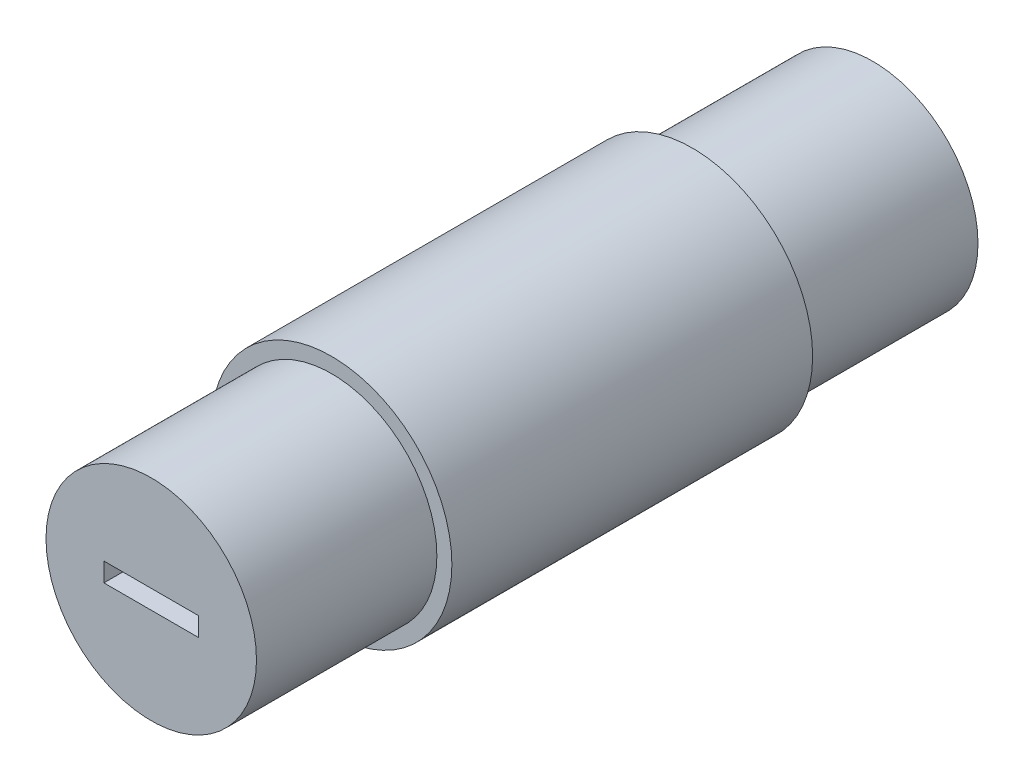
ISO-10303-21;
HEADER;
FILE_DESCRIPTION(('STEP AP214'),'2;1');
FILE_NAME('part.step','',(''),(''),'','','');
FILE_SCHEMA(('AUTOMOTIVE_DESIGN { 1 0 10303 214 1 1 1 1 }'));
ENDSEC;
DATA;
#1=APPLICATION_CONTEXT('core data for automotive mechanical design processes');
#2=APPLICATION_PROTOCOL_DEFINITION('international standard','automotive_design',2000,#1);
#3=PRODUCT_CONTEXT('',#1,'mechanical');
#4=PRODUCT('Part','Part','',(#3));
#5=PRODUCT_RELATED_PRODUCT_CATEGORY('part','',(#4));
#6=PRODUCT_DEFINITION_FORMATION('','',#4);
#7=PRODUCT_DEFINITION_CONTEXT('part definition',#1,'design');
#8=PRODUCT_DEFINITION('design','',#6,#7);
#9=PRODUCT_DEFINITION_SHAPE('','',#8);
#10=(LENGTH_UNIT() NAMED_UNIT(*) SI_UNIT(.MILLI.,.METRE.));
#11=(NAMED_UNIT(*) PLANE_ANGLE_UNIT() SI_UNIT($,.RADIAN.));
#12=(NAMED_UNIT(*) SI_UNIT($,.STERADIAN.) SOLID_ANGLE_UNIT());
#13=UNCERTAINTY_MEASURE_WITH_UNIT(LENGTH_MEASURE(1.E-05),#10,'distance_accuracy_value','');
#14=(GEOMETRIC_REPRESENTATION_CONTEXT(3) GLOBAL_UNCERTAINTY_ASSIGNED_CONTEXT((#13)) GLOBAL_UNIT_ASSIGNED_CONTEXT((#10,
#11,#12)) REPRESENTATION_CONTEXT('',''));
#15=CARTESIAN_POINT('',(0.,0.,0.));
#16=DIRECTION('',(0.,0.,1.));
#17=DIRECTION('',(1.,0.,0.));
#18=AXIS2_PLACEMENT_3D('',#15,#16,#17);
#19=CARTESIAN_POINT('',(0.,0.,-38.1));
#20=DIRECTION('',(0.,0.,1.));
#21=DIRECTION('',(1.,0.,0.));
#22=AXIS2_PLACEMENT_3D('',#19,#20,#21);
#23=PLANE('',#22);
#24=CARTESIAN_POINT('',(0.,0.,-38.1));
#25=DIRECTION('',(0.,0.,1.));
#26=DIRECTION('',(1.,0.,0.));
#27=AXIS2_PLACEMENT_3D('',#24,#25,#26);
#28=CIRCLE('',#27,11.115);
#29=CARTESIAN_POINT('',(11.1149999999999,0.,-38.1));
#30=VERTEX_POINT('',#29);
#31=EDGE_CURVE('E719',#30,#30,#28,.T.);
#32=ORIENTED_EDGE('',*,*,#31,.F.);
#33=EDGE_LOOP('',(#32));
#34=FACE_BOUND('',#33,.T.);
#35=DIRECTION('',(0.,-1.,0.));
#36=VECTOR('',#35,1.);
#37=CARTESIAN_POINT('',(-5.00000000000009,1.,-38.1));
#38=LINE('',#37,#36);
#39=CARTESIAN_POINT('',(-5.00000000000009,1.,-38.1));
#40=VERTEX_POINT('',#39);
#41=CARTESIAN_POINT('',(-5.00000000000009,-1.,-38.1));
#42=VERTEX_POINT('',#41);
#43=EDGE_CURVE('E606',#40,#42,#38,.T.);
#44=ORIENTED_EDGE('',*,*,#43,.T.);
#45=DIRECTION('',(1.,0.,0.));
#46=VECTOR('',#45,1.);
#47=CARTESIAN_POINT('',(-5.00000000000009,-1.,-38.1));
#48=LINE('',#47,#46);
#49=CARTESIAN_POINT('',(4.99999999999993,-1.,-38.1));
#50=VERTEX_POINT('',#49);
#51=EDGE_CURVE('E677',#42,#50,#48,.T.);
#52=ORIENTED_EDGE('',*,*,#51,.T.);
#53=DIRECTION('',(0.,1.,0.));
#54=VECTOR('',#53,1.);
#55=CARTESIAN_POINT('',(4.99999999999993,1.,-38.1));
#56=LINE('',#55,#54);
#57=CARTESIAN_POINT('',(4.99999999999993,1.,-38.1));
#58=VERTEX_POINT('',#57);
#59=EDGE_CURVE('E663',#50,#58,#56,.T.);
#60=ORIENTED_EDGE('',*,*,#59,.T.);
#61=DIRECTION('',(-1.,0.,0.));
#62=VECTOR('',#61,1.);
#63=CARTESIAN_POINT('',(-5.00000000000009,1.,-38.1));
#64=LINE('',#63,#62);
#65=EDGE_CURVE('E673',#58,#40,#64,.T.);
#66=ORIENTED_EDGE('',*,*,#65,.T.);
#67=EDGE_LOOP('',(#44,#52,#60,#66));
#68=FACE_BOUND('',#67,.T.);
#69=ADVANCED_FACE('F591',(#34,#68),#23,.F.);
#70=CARTESIAN_POINT('',(0.,0.,38.1));
#71=DIRECTION('',(0.,0.,-1.));
#72=DIRECTION('',(-1.,0.,0.));
#73=AXIS2_PLACEMENT_3D('',#70,#71,#72);
#74=CYLINDRICAL_SURFACE('',#73,12.7);
#75=CARTESIAN_POINT('',(0.,0.,19.05));
#76=DIRECTION('',(0.,0.,1.));
#77=DIRECTION('',(1.,0.,0.));
#78=AXIS2_PLACEMENT_3D('',#75,#76,#77);
#79=CIRCLE('',#78,12.7);
#80=CARTESIAN_POINT('',(12.7,0.,19.05));
#81=VERTEX_POINT('',#80);
#82=EDGE_CURVE('E12',#81,#81,#79,.T.);
#83=ORIENTED_EDGE('',*,*,#82,.F.);
#84=EDGE_LOOP('',(#83));
#85=FACE_BOUND('',#84,.T.);
#86=CARTESIAN_POINT('',(0.,0.,-19.05));
#87=DIRECTION('',(0.,0.,1.));
#88=DIRECTION('',(1.,0.,0.));
#89=AXIS2_PLACEMENT_3D('',#86,#87,#88);
#90=CIRCLE('',#89,12.7);
#91=CARTESIAN_POINT('',(12.7,0.,-19.05));
#92=VERTEX_POINT('',#91);
#93=EDGE_CURVE('E730',#92,#92,#90,.T.);
#94=ORIENTED_EDGE('',*,*,#93,.T.);
#95=EDGE_LOOP('',(#94));
#96=FACE_BOUND('',#95,.T.);
#97=ADVANCED_FACE('F593',(#85,#96),#74,.T.);
#98=CARTESIAN_POINT('',(0.,0.,19.05));
#99=DIRECTION('',(0.,0.,1.));
#100=DIRECTION('',(1.,0.,0.));
#101=AXIS2_PLACEMENT_3D('',#98,#99,#100);
#102=PLANE('',#101);
#103=CARTESIAN_POINT('',(0.,0.,19.05));
#104=DIRECTION('',(0.,0.,1.));
#105=DIRECTION('',(1.,0.,0.));
#106=AXIS2_PLACEMENT_3D('',#103,#104,#105);
#107=CIRCLE('',#106,11.115);
#108=CARTESIAN_POINT('',(11.115,0.,19.05));
#109=VERTEX_POINT('',#108);
#110=EDGE_CURVE('E599',#109,#109,#107,.T.);
#111=ORIENTED_EDGE('',*,*,#110,.F.);
#112=EDGE_LOOP('',(#111));
#113=FACE_BOUND('',#112,.T.);
#114=ORIENTED_EDGE('',*,*,#82,.T.);
#115=EDGE_LOOP('',(#114));
#116=FACE_BOUND('',#115,.T.);
#117=ADVANCED_FACE('F741',(#113,#116),#102,.T.);
#118=CARTESIAN_POINT('',(0.,0.,19.05));
#119=DIRECTION('',(0.,0.,1.));
#120=DIRECTION('',(1.,0.,0.));
#121=AXIS2_PLACEMENT_3D('',#118,#119,#120);
#122=CYLINDRICAL_SURFACE('',#121,11.115);
#123=ORIENTED_EDGE('',*,*,#110,.T.);
#124=EDGE_LOOP('',(#123));
#125=FACE_BOUND('',#124,.T.);
#126=CARTESIAN_POINT('',(0.,0.,38.1));
#127=DIRECTION('',(0.,0.,1.));
#128=DIRECTION('',(1.,0.,0.));
#129=AXIS2_PLACEMENT_3D('',#126,#127,#128);
#130=CIRCLE('',#129,11.115);
#131=CARTESIAN_POINT('',(11.1150000000001,0.,38.1));
#132=VERTEX_POINT('',#131);
#133=EDGE_CURVE('E733',#132,#132,#130,.T.);
#134=ORIENTED_EDGE('',*,*,#133,.F.);
#135=EDGE_LOOP('',(#134));
#136=FACE_BOUND('',#135,.T.);
#137=ADVANCED_FACE('F738',(#125,#136),#122,.T.);
#138=CARTESIAN_POINT('',(0.,0.,38.1));
#139=DIRECTION('',(0.,0.,1.));
#140=DIRECTION('',(1.,0.,0.));
#141=AXIS2_PLACEMENT_3D('',#138,#139,#140);
#142=PLANE('',#141);
#143=DIRECTION('',(0.,-1.,0.));
#144=VECTOR('',#143,1.);
#145=CARTESIAN_POINT('',(-4.99999999999993,1.,38.1));
#146=LINE('',#145,#144);
#147=CARTESIAN_POINT('',(-4.99999999999993,1.,38.1));
#148=VERTEX_POINT('',#147);
#149=CARTESIAN_POINT('',(-4.99999999999993,-1.,38.1));
#150=VERTEX_POINT('',#149);
#151=EDGE_CURVE('E614',#148,#150,#146,.T.);
#152=ORIENTED_EDGE('',*,*,#151,.F.);
#153=DIRECTION('',(-1.,0.,0.));
#154=VECTOR('',#153,1.);
#155=CARTESIAN_POINT('',(-4.99999999999993,1.,38.1));
#156=LINE('',#155,#154);
#157=CARTESIAN_POINT('',(5.00000000000009,1.,38.1));
#158=VERTEX_POINT('',#157);
#159=EDGE_CURVE('E701',#158,#148,#156,.T.);
#160=ORIENTED_EDGE('',*,*,#159,.F.);
#161=DIRECTION('',(0.,1.,0.));
#162=VECTOR('',#161,1.);
#163=CARTESIAN_POINT('',(5.00000000000009,1.,38.1));
#164=LINE('',#163,#162);
#165=CARTESIAN_POINT('',(5.00000000000009,-1.,38.1));
#166=VERTEX_POINT('',#165);
#167=EDGE_CURVE('E698',#166,#158,#164,.T.);
#168=ORIENTED_EDGE('',*,*,#167,.F.);
#169=DIRECTION('',(1.,0.,0.));
#170=VECTOR('',#169,1.);
#171=CARTESIAN_POINT('',(-4.99999999999993,-1.,38.1));
#172=LINE('',#171,#170);
#173=EDGE_CURVE('E695',#150,#166,#172,.T.);
#174=ORIENTED_EDGE('',*,*,#173,.F.);
#175=EDGE_LOOP('',(#152,#160,#168,#174));
#176=FACE_BOUND('',#175,.T.);
#177=ORIENTED_EDGE('',*,*,#133,.T.);
#178=EDGE_LOOP('',(#177));
#179=FACE_BOUND('',#178,.T.);
#180=ADVANCED_FACE('F755',(#176,#179),#142,.T.);
#181=CARTESIAN_POINT('',(0.,0.,-19.05));
#182=DIRECTION('',(0.,0.,-1.));
#183=DIRECTION('',(1.,0.,0.));
#184=AXIS2_PLACEMENT_3D('',#181,#182,#183);
#185=PLANE('',#184);
#186=ORIENTED_EDGE('',*,*,#93,.F.);
#187=EDGE_LOOP('',(#186));
#188=FACE_BOUND('',#187,.T.);
#189=CARTESIAN_POINT('',(0.,0.,-19.05));
#190=DIRECTION('',(0.,0.,1.));
#191=DIRECTION('',(1.,0.,0.));
#192=AXIS2_PLACEMENT_3D('',#189,#190,#191);
#193=CIRCLE('',#192,11.115);
#194=CARTESIAN_POINT('',(11.115,0.,-19.05));
#195=VERTEX_POINT('',#194);
#196=EDGE_CURVE('E727',#195,#195,#193,.T.);
#197=ORIENTED_EDGE('',*,*,#196,.T.);
#198=EDGE_LOOP('',(#197));
#199=FACE_BOUND('',#198,.T.);
#200=ADVANCED_FACE('F751',(#188,#199),#185,.T.);
#201=CARTESIAN_POINT('',(0.,0.,-19.05));
#202=DIRECTION('',(0.,0.,-1.));
#203=DIRECTION('',(-1.,0.,0.));
#204=AXIS2_PLACEMENT_3D('',#201,#202,#203);
#205=CYLINDRICAL_SURFACE('',#204,11.115);
#206=ORIENTED_EDGE('',*,*,#196,.F.);
#207=EDGE_LOOP('',(#206));
#208=FACE_BOUND('',#207,.T.);
#209=ORIENTED_EDGE('',*,*,#31,.T.);
#210=EDGE_LOOP('',(#209));
#211=FACE_BOUND('',#210,.T.);
#212=ADVANCED_FACE('F754',(#208,#211),#205,.T.);
#213=CARTESIAN_POINT('',(-4.99999999999995,1.,32.1));
#214=DIRECTION('',(-1.,0.,0.));
#215=DIRECTION('',(0.,0.,1.));
#216=AXIS2_PLACEMENT_3D('',#213,#214,#215);
#217=PLANE('',#216);
#218=ORIENTED_EDGE('',*,*,#151,.T.);
#219=DIRECTION('',(0.,0.,1.));
#220=VECTOR('',#219,1.);
#221=CARTESIAN_POINT('',(-4.99999999999995,-1.,32.1));
#222=LINE('',#221,#220);
#223=CARTESIAN_POINT('',(-4.99999999999995,-1.,32.1));
#224=VERTEX_POINT('',#223);
#225=EDGE_CURVE('E716',#224,#150,#222,.T.);
#226=ORIENTED_EDGE('',*,*,#225,.F.);
#227=DIRECTION('',(0.,-1.,0.));
#228=VECTOR('',#227,1.);
#229=CARTESIAN_POINT('',(-4.99999999999995,1.,32.1));
#230=LINE('',#229,#228);
#231=CARTESIAN_POINT('',(-4.99999999999995,1.,32.1));
#232=VERTEX_POINT('',#231);
#233=EDGE_CURVE('E704',#232,#224,#230,.T.);
#234=ORIENTED_EDGE('',*,*,#233,.F.);
#235=DIRECTION('',(0.,0.,1.));
#236=VECTOR('',#235,1.);
#237=CARTESIAN_POINT('',(-4.99999999999995,1.,32.1));
#238=LINE('',#237,#236);
#239=EDGE_CURVE('E717',#232,#148,#238,.T.);
#240=ORIENTED_EDGE('',*,*,#239,.T.);
#241=EDGE_LOOP('',(#218,#226,#234,#240));
#242=FACE_BOUND('',#241,.T.);
#243=ADVANCED_FACE('F761',(#242),#217,.F.);
#244=CARTESIAN_POINT('',(-4.99999999999995,1.,32.1));
#245=DIRECTION('',(0.,1.,0.));
#246=DIRECTION('',(-1.,0.,0.));
#247=AXIS2_PLACEMENT_3D('',#244,#245,#246);
#248=PLANE('',#247);
#249=ORIENTED_EDGE('',*,*,#159,.T.);
#250=ORIENTED_EDGE('',*,*,#239,.F.);
#251=DIRECTION('',(-1.,0.,0.));
#252=VECTOR('',#251,1.);
#253=CARTESIAN_POINT('',(-4.99999999999995,1.,32.1));
#254=LINE('',#253,#252);
#255=CARTESIAN_POINT('',(5.00000000000007,1.,32.1));
#256=VERTEX_POINT('',#255);
#257=EDGE_CURVE('E713',#256,#232,#254,.T.);
#258=ORIENTED_EDGE('',*,*,#257,.F.);
#259=DIRECTION('',(0.,0.,1.));
#260=VECTOR('',#259,1.);
#261=CARTESIAN_POINT('',(5.00000000000007,1.,32.1));
#262=LINE('',#261,#260);
#263=EDGE_CURVE('E720',#256,#158,#262,.T.);
#264=ORIENTED_EDGE('',*,*,#263,.T.);
#265=EDGE_LOOP('',(#249,#250,#258,#264));
#266=FACE_BOUND('',#265,.T.);
#267=ADVANCED_FACE('F789',(#266),#248,.F.);
#268=CARTESIAN_POINT('',(5.00000000000007,1.,32.1));
#269=DIRECTION('',(1.,0.,0.));
#270=DIRECTION('',(0.,0.,-1.));
#271=AXIS2_PLACEMENT_3D('',#268,#269,#270);
#272=PLANE('',#271);
#273=ORIENTED_EDGE('',*,*,#167,.T.);
#274=ORIENTED_EDGE('',*,*,#263,.F.);
#275=DIRECTION('',(0.,1.,0.));
#276=VECTOR('',#275,1.);
#277=CARTESIAN_POINT('',(5.00000000000007,1.,32.1));
#278=LINE('',#277,#276);
#279=CARTESIAN_POINT('',(5.00000000000007,-1.,32.1));
#280=VERTEX_POINT('',#279);
#281=EDGE_CURVE('E710',#280,#256,#278,.T.);
#282=ORIENTED_EDGE('',*,*,#281,.F.);
#283=DIRECTION('',(0.,0.,1.));
#284=VECTOR('',#283,1.);
#285=CARTESIAN_POINT('',(5.00000000000007,-1.,32.1));
#286=LINE('',#285,#284);
#287=EDGE_CURVE('E722',#280,#166,#286,.T.);
#288=ORIENTED_EDGE('',*,*,#287,.T.);
#289=EDGE_LOOP('',(#273,#274,#282,#288));
#290=FACE_BOUND('',#289,.T.);
#291=ADVANCED_FACE('F791',(#290),#272,.F.);
#292=CARTESIAN_POINT('',(-4.99999999999995,-1.,32.1));
#293=DIRECTION('',(0.,-1.,0.));
#294=DIRECTION('',(1.,0.,0.));
#295=AXIS2_PLACEMENT_3D('',#292,#293,#294);
#296=PLANE('',#295);
#297=ORIENTED_EDGE('',*,*,#173,.T.);
#298=ORIENTED_EDGE('',*,*,#287,.F.);
#299=DIRECTION('',(1.,0.,0.));
#300=VECTOR('',#299,1.);
#301=CARTESIAN_POINT('',(-4.99999999999995,-1.,32.1));
#302=LINE('',#301,#300);
#303=EDGE_CURVE('E707',#224,#280,#302,.T.);
#304=ORIENTED_EDGE('',*,*,#303,.F.);
#305=ORIENTED_EDGE('',*,*,#225,.T.);
#306=EDGE_LOOP('',(#297,#298,#304,#305));
#307=FACE_BOUND('',#306,.T.);
#308=ADVANCED_FACE('F781',(#307),#296,.F.);
#309=CARTESIAN_POINT('',(-4.99999999999995,-1.,32.1));
#310=DIRECTION('',(0.,0.,1.));
#311=DIRECTION('',(1.,0.,0.));
#312=AXIS2_PLACEMENT_3D('',#309,#310,#311);
#313=PLANE('',#312);
#314=ORIENTED_EDGE('',*,*,#233,.T.);
#315=ORIENTED_EDGE('',*,*,#303,.T.);
#316=ORIENTED_EDGE('',*,*,#281,.T.);
#317=ORIENTED_EDGE('',*,*,#257,.T.);
#318=EDGE_LOOP('',(#314,#315,#316,#317));
#319=FACE_BOUND('',#318,.T.);
#320=ADVANCED_FACE('F787',(#319),#313,.T.);
#321=CARTESIAN_POINT('',(-5.00000000000007,1.,-32.1));
#322=DIRECTION('',(1.,0.,0.));
#323=DIRECTION('',(0.,0.,-1.));
#324=AXIS2_PLACEMENT_3D('',#321,#322,#323);
#325=PLANE('',#324);
#326=ORIENTED_EDGE('',*,*,#43,.F.);
#327=DIRECTION('',(0.,0.,-1.));
#328=VECTOR('',#327,1.);
#329=CARTESIAN_POINT('',(-5.00000000000007,1.,-32.1));
#330=LINE('',#329,#328);
#331=CARTESIAN_POINT('',(-5.00000000000007,1.,-32.1));
#332=VERTEX_POINT('',#331);
#333=EDGE_CURVE('E670',#332,#40,#330,.T.);
#334=ORIENTED_EDGE('',*,*,#333,.F.);
#335=DIRECTION('',(0.,-1.,0.));
#336=VECTOR('',#335,1.);
#337=CARTESIAN_POINT('',(-5.00000000000007,1.,-32.1));
#338=LINE('',#337,#336);
#339=CARTESIAN_POINT('',(-5.00000000000007,-1.,-32.1));
#340=VERTEX_POINT('',#339);
#341=EDGE_CURVE('E679',#332,#340,#338,.T.);
#342=ORIENTED_EDGE('',*,*,#341,.T.);
#343=DIRECTION('',(0.,0.,-1.));
#344=VECTOR('',#343,1.);
#345=CARTESIAN_POINT('',(-5.00000000000007,-1.,-32.1));
#346=LINE('',#345,#344);
#347=EDGE_CURVE('E690',#340,#42,#346,.T.);
#348=ORIENTED_EDGE('',*,*,#347,.T.);
#349=EDGE_LOOP('',(#326,#334,#342,#348));
#350=FACE_BOUND('',#349,.T.);
#351=ADVANCED_FACE('F823',(#350),#325,.T.);
#352=CARTESIAN_POINT('',(-5.00000000000007,-1.,-32.1));
#353=DIRECTION('',(0.,1.,0.));
#354=DIRECTION('',(-1.,0.,0.));
#355=AXIS2_PLACEMENT_3D('',#352,#353,#354);
#356=PLANE('',#355);
#357=ORIENTED_EDGE('',*,*,#51,.F.);
#358=ORIENTED_EDGE('',*,*,#347,.F.);
#359=DIRECTION('',(1.,0.,0.));
#360=VECTOR('',#359,1.);
#361=CARTESIAN_POINT('',(-5.00000000000007,-1.,-32.1));
#362=LINE('',#361,#360);
#363=CARTESIAN_POINT('',(4.99999999999995,-1.,-32.1));
#364=VERTEX_POINT('',#363);
#365=EDGE_CURVE('E688',#340,#364,#362,.T.);
#366=ORIENTED_EDGE('',*,*,#365,.T.);
#367=DIRECTION('',(0.,0.,-1.));
#368=VECTOR('',#367,1.);
#369=CARTESIAN_POINT('',(4.99999999999995,-1.,-32.1));
#370=LINE('',#369,#368);
#371=EDGE_CURVE('E669',#364,#50,#370,.T.);
#372=ORIENTED_EDGE('',*,*,#371,.T.);
#373=EDGE_LOOP('',(#357,#358,#366,#372));
#374=FACE_BOUND('',#373,.T.);
#375=ADVANCED_FACE('F832',(#374),#356,.T.);
#376=CARTESIAN_POINT('',(4.99999999999995,1.,-32.1));
#377=DIRECTION('',(-1.,0.,0.));
#378=DIRECTION('',(0.,0.,1.));
#379=AXIS2_PLACEMENT_3D('',#376,#377,#378);
#380=PLANE('',#379);
#381=ORIENTED_EDGE('',*,*,#59,.F.);
#382=ORIENTED_EDGE('',*,*,#371,.F.);
#383=DIRECTION('',(0.,1.,0.));
#384=VECTOR('',#383,1.);
#385=CARTESIAN_POINT('',(4.99999999999995,1.,-32.1));
#386=LINE('',#385,#384);
#387=CARTESIAN_POINT('',(4.99999999999995,1.,-32.1));
#388=VERTEX_POINT('',#387);
#389=EDGE_CURVE('E666',#364,#388,#386,.T.);
#390=ORIENTED_EDGE('',*,*,#389,.T.);
#391=DIRECTION('',(0.,0.,-1.));
#392=VECTOR('',#391,1.);
#393=CARTESIAN_POINT('',(4.99999999999995,1.,-32.1));
#394=LINE('',#393,#392);
#395=EDGE_CURVE('E658',#388,#58,#394,.T.);
#396=ORIENTED_EDGE('',*,*,#395,.T.);
#397=EDGE_LOOP('',(#381,#382,#390,#396));
#398=FACE_BOUND('',#397,.T.);
#399=ADVANCED_FACE('F660',(#398),#380,.T.);
#400=CARTESIAN_POINT('',(-5.00000000000007,1.,-32.1));
#401=DIRECTION('',(0.,-1.,0.));
#402=DIRECTION('',(1.,0.,0.));
#403=AXIS2_PLACEMENT_3D('',#400,#401,#402);
#404=PLANE('',#403);
#405=ORIENTED_EDGE('',*,*,#65,.F.);
#406=ORIENTED_EDGE('',*,*,#395,.F.);
#407=DIRECTION('',(-1.,0.,0.));
#408=VECTOR('',#407,1.);
#409=CARTESIAN_POINT('',(-5.00000000000007,1.,-32.1));
#410=LINE('',#409,#408);
#411=EDGE_CURVE('E685',#388,#332,#410,.T.);
#412=ORIENTED_EDGE('',*,*,#411,.T.);
#413=ORIENTED_EDGE('',*,*,#333,.T.);
#414=EDGE_LOOP('',(#405,#406,#412,#413));
#415=FACE_BOUND('',#414,.T.);
#416=ADVANCED_FACE('F674',(#415),#404,.T.);
#417=CARTESIAN_POINT('',(-5.00000000000007,-1.,-32.1));
#418=DIRECTION('',(0.,0.,-1.));
#419=DIRECTION('',(1.,0.,0.));
#420=AXIS2_PLACEMENT_3D('',#417,#418,#419);
#421=PLANE('',#420);
#422=ORIENTED_EDGE('',*,*,#341,.F.);
#423=ORIENTED_EDGE('',*,*,#411,.F.);
#424=ORIENTED_EDGE('',*,*,#389,.F.);
#425=ORIENTED_EDGE('',*,*,#365,.F.);
#426=EDGE_LOOP('',(#422,#423,#424,#425));
#427=FACE_BOUND('',#426,.T.);
#428=ADVANCED_FACE('F852',(#427),#421,.T.);
#429=CLOSED_SHELL('',(#69,#97,#117,#137,#180,#200,#212,#243,#267,#291,#308,#320,#351,#375,#399,
#416,#428));
#430=MANIFOLD_SOLID_BREP('B2',#429);
#431=ADVANCED_BREP_SHAPE_REPRESENTATION('',(#18,#430),#14);
#432=SHAPE_DEFINITION_REPRESENTATION(#9,#431);
ENDSEC;
END-ISO-10303-21;
